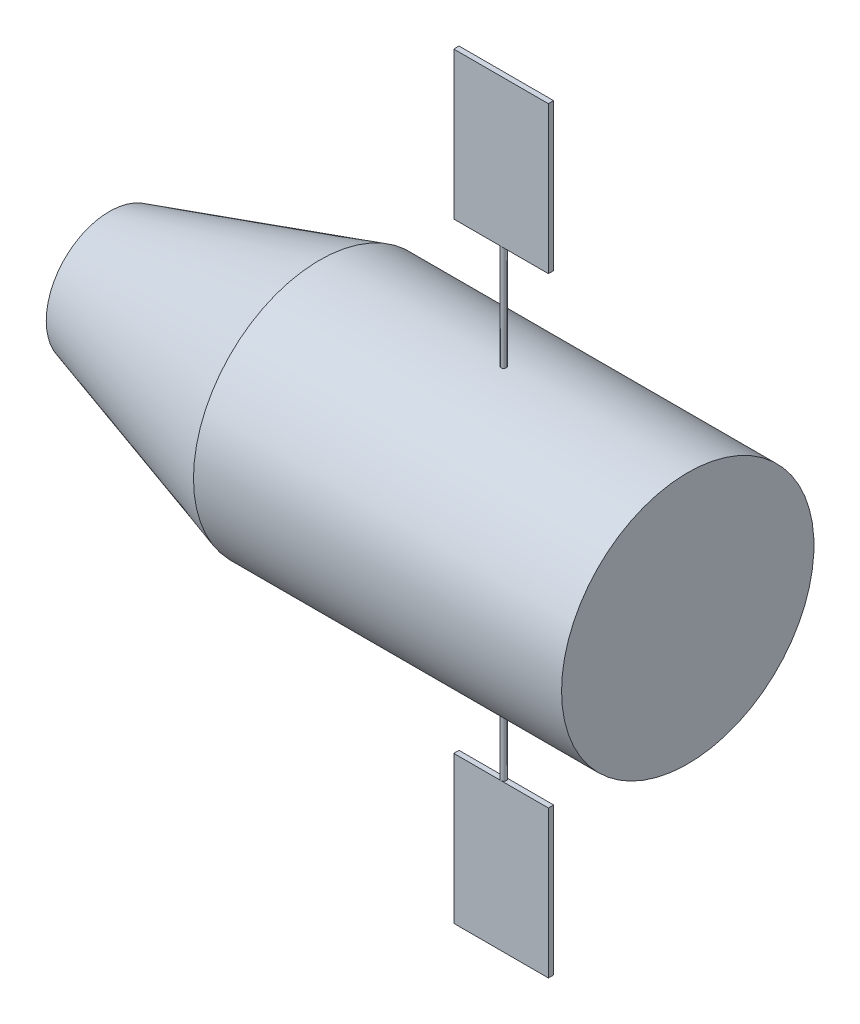
ISO-10303-21;
HEADER;
FILE_DESCRIPTION(('STEP AP214'),'2;1');
FILE_NAME('part.step','',(''),(''),'','','');
FILE_SCHEMA(('AUTOMOTIVE_DESIGN { 1 0 10303 214 1 1 1 1 }'));
ENDSEC;
DATA;
#1=APPLICATION_CONTEXT('core data for automotive mechanical design processes');
#2=APPLICATION_PROTOCOL_DEFINITION('international standard','automotive_design',2000,#1);
#3=PRODUCT_CONTEXT('',#1,'mechanical');
#4=PRODUCT('Part','Part','',(#3));
#5=PRODUCT_RELATED_PRODUCT_CATEGORY('part','',(#4));
#6=PRODUCT_DEFINITION_FORMATION('','',#4);
#7=PRODUCT_DEFINITION_CONTEXT('part definition',#1,'design');
#8=PRODUCT_DEFINITION('design','',#6,#7);
#9=PRODUCT_DEFINITION_SHAPE('','',#8);
#10=(LENGTH_UNIT() NAMED_UNIT(*) SI_UNIT(.MILLI.,.METRE.));
#11=(NAMED_UNIT(*) PLANE_ANGLE_UNIT() SI_UNIT($,.RADIAN.));
#12=(NAMED_UNIT(*) SI_UNIT($,.STERADIAN.) SOLID_ANGLE_UNIT());
#13=UNCERTAINTY_MEASURE_WITH_UNIT(LENGTH_MEASURE(1.E-05),#10,'distance_accuracy_value','');
#14=(GEOMETRIC_REPRESENTATION_CONTEXT(3) GLOBAL_UNCERTAINTY_ASSIGNED_CONTEXT((#13)) GLOBAL_UNIT_ASSIGNED_CONTEXT((#10,
#11,#12)) REPRESENTATION_CONTEXT('',''));
#15=CARTESIAN_POINT('',(0.,0.,0.));
#16=DIRECTION('',(0.,0.,1.));
#17=DIRECTION('',(1.,0.,0.));
#18=AXIS2_PLACEMENT_3D('',#15,#16,#17);
#19=CARTESIAN_POINT('',(66.,-44.,0.5));
#20=DIRECTION('',(0.,-1.,0.));
#21=DIRECTION('',(0.,0.,-1.));
#22=AXIS2_PLACEMENT_3D('',#19,#20,#21);
#23=PLANE('',#22);
#24=DIRECTION('',(-1.,0.,0.));
#25=VECTOR('',#24,1.);
#26=CARTESIAN_POINT('',(66.,-44.,-0.5));
#27=LINE('',#26,#25);
#28=CARTESIAN_POINT('',(84.,-44.,-0.5));
#29=VERTEX_POINT('',#28);
#30=CARTESIAN_POINT('',(66.,-44.,-0.5));
#31=VERTEX_POINT('',#30);
#32=EDGE_CURVE('E87',#29,#31,#27,.T.);
#33=ORIENTED_EDGE('',*,*,#32,.T.);
#34=DIRECTION('',(0.,0.,-1.));
#35=VECTOR('',#34,1.);
#36=CARTESIAN_POINT('',(66.,-44.,0.5));
#37=LINE('',#36,#35);
#38=CARTESIAN_POINT('',(66.,-44.,0.5));
#39=VERTEX_POINT('',#38);
#40=EDGE_CURVE('E12',#39,#31,#37,.T.);
#41=ORIENTED_EDGE('',*,*,#40,.F.);
#42=DIRECTION('',(-1.,0.,0.));
#43=VECTOR('',#42,1.);
#44=CARTESIAN_POINT('',(66.,-44.,0.5));
#45=LINE('',#44,#43);
#46=CARTESIAN_POINT('',(84.,-44.,0.5));
#47=VERTEX_POINT('',#46);
#48=EDGE_CURVE('E105',#47,#39,#45,.T.);
#49=ORIENTED_EDGE('',*,*,#48,.F.);
#50=DIRECTION('',(0.,0.,-1.));
#51=VECTOR('',#50,1.);
#52=CARTESIAN_POINT('',(84.,-44.,0.5));
#53=LINE('',#52,#51);
#54=EDGE_CURVE('E99',#47,#29,#53,.T.);
#55=ORIENTED_EDGE('',*,*,#54,.T.);
#56=EDGE_LOOP('',(#33,#41,#49,#55));
#57=FACE_BOUND('',#56,.T.);
#58=ADVANCED_FACE('F43',(#57),#23,.F.);
#59=CARTESIAN_POINT('',(66.,-44.,0.5));
#60=DIRECTION('',(1.,0.,0.));
#61=DIRECTION('',(0.,0.,-1.));
#62=AXIS2_PLACEMENT_3D('',#59,#60,#61);
#63=PLANE('',#62);
#64=DIRECTION('',(0.,-1.,0.));
#65=VECTOR('',#64,1.);
#66=CARTESIAN_POINT('',(66.,-44.,-0.5));
#67=LINE('',#66,#65);
#68=CARTESIAN_POINT('',(66.,-72.,-0.5));
#69=VERTEX_POINT('',#68);
#70=EDGE_CURVE('E83',#31,#69,#67,.T.);
#71=ORIENTED_EDGE('',*,*,#70,.T.);
#72=DIRECTION('',(0.,0.,-1.));
#73=VECTOR('',#72,1.);
#74=CARTESIAN_POINT('',(66.,-72.,0.5));
#75=LINE('',#74,#73);
#76=CARTESIAN_POINT('',(66.,-72.,0.5));
#77=VERTEX_POINT('',#76);
#78=EDGE_CURVE('E50',#77,#69,#75,.T.);
#79=ORIENTED_EDGE('',*,*,#78,.F.);
#80=DIRECTION('',(0.,-1.,0.));
#81=VECTOR('',#80,1.);
#82=CARTESIAN_POINT('',(66.,-44.,0.5));
#83=LINE('',#82,#81);
#84=EDGE_CURVE('E95',#39,#77,#83,.T.);
#85=ORIENTED_EDGE('',*,*,#84,.F.);
#86=ORIENTED_EDGE('',*,*,#40,.T.);
#87=EDGE_LOOP('',(#71,#79,#85,#86));
#88=FACE_BOUND('',#87,.T.);
#89=ADVANCED_FACE('F94',(#88),#63,.F.);
#90=CARTESIAN_POINT('',(66.,-72.,0.5));
#91=DIRECTION('',(0.,1.,0.));
#92=DIRECTION('',(0.,0.,1.));
#93=AXIS2_PLACEMENT_3D('',#90,#91,#92);
#94=PLANE('',#93);
#95=DIRECTION('',(1.,0.,0.));
#96=VECTOR('',#95,1.);
#97=CARTESIAN_POINT('',(66.,-72.,-0.5));
#98=LINE('',#97,#96);
#99=CARTESIAN_POINT('',(84.,-72.,-0.5));
#100=VERTEX_POINT('',#99);
#101=EDGE_CURVE('E88',#69,#100,#98,.T.);
#102=ORIENTED_EDGE('',*,*,#101,.T.);
#103=DIRECTION('',(0.,0.,-1.));
#104=VECTOR('',#103,1.);
#105=CARTESIAN_POINT('',(84.,-72.,0.5));
#106=LINE('',#105,#104);
#107=CARTESIAN_POINT('',(84.,-72.,0.5));
#108=VERTEX_POINT('',#107);
#109=EDGE_CURVE('E111',#108,#100,#106,.T.);
#110=ORIENTED_EDGE('',*,*,#109,.F.);
#111=DIRECTION('',(1.,0.,0.));
#112=VECTOR('',#111,1.);
#113=CARTESIAN_POINT('',(66.,-72.,0.5));
#114=LINE('',#113,#112);
#115=EDGE_CURVE('E62',#77,#108,#114,.T.);
#116=ORIENTED_EDGE('',*,*,#115,.F.);
#117=ORIENTED_EDGE('',*,*,#78,.T.);
#118=EDGE_LOOP('',(#102,#110,#116,#117));
#119=FACE_BOUND('',#118,.T.);
#120=ADVANCED_FACE('F114',(#119),#94,.F.);
#121=CARTESIAN_POINT('',(84.,-44.,0.5));
#122=DIRECTION('',(-1.,0.,0.));
#123=DIRECTION('',(0.,0.,1.));
#124=AXIS2_PLACEMENT_3D('',#121,#122,#123);
#125=PLANE('',#124);
#126=DIRECTION('',(0.,1.,0.));
#127=VECTOR('',#126,1.);
#128=CARTESIAN_POINT('',(84.,-44.,-0.5));
#129=LINE('',#128,#127);
#130=EDGE_CURVE('E103',#100,#29,#129,.T.);
#131=ORIENTED_EDGE('',*,*,#130,.T.);
#132=ORIENTED_EDGE('',*,*,#54,.F.);
#133=DIRECTION('',(0.,1.,0.));
#134=VECTOR('',#133,1.);
#135=CARTESIAN_POINT('',(84.,-44.,0.5));
#136=LINE('',#135,#134);
#137=EDGE_CURVE('E57',#108,#47,#136,.T.);
#138=ORIENTED_EDGE('',*,*,#137,.F.);
#139=ORIENTED_EDGE('',*,*,#109,.T.);
#140=EDGE_LOOP('',(#131,#132,#138,#139));
#141=FACE_BOUND('',#140,.T.);
#142=ADVANCED_FACE('F116',(#141),#125,.F.);
#143=CARTESIAN_POINT('',(84.,-44.,0.5));
#144=DIRECTION('',(0.,0.,-1.));
#145=DIRECTION('',(-1.,0.,0.));
#146=AXIS2_PLACEMENT_3D('',#143,#144,#145);
#147=PLANE('',#146);
#148=ORIENTED_EDGE('',*,*,#48,.T.);
#149=ORIENTED_EDGE('',*,*,#84,.T.);
#150=ORIENTED_EDGE('',*,*,#115,.T.);
#151=ORIENTED_EDGE('',*,*,#137,.T.);
#152=EDGE_LOOP('',(#148,#149,#150,#151));
#153=FACE_BOUND('',#152,.T.);
#154=ADVANCED_FACE('F117',(#153),#147,.F.);
#155=CARTESIAN_POINT('',(84.,-44.,-0.5));
#156=DIRECTION('',(0.,0.,-1.));
#157=DIRECTION('',(-1.,0.,0.));
#158=AXIS2_PLACEMENT_3D('',#155,#156,#157);
#159=PLANE('',#158);
#160=ORIENTED_EDGE('',*,*,#32,.F.);
#161=ORIENTED_EDGE('',*,*,#130,.F.);
#162=ORIENTED_EDGE('',*,*,#101,.F.);
#163=ORIENTED_EDGE('',*,*,#70,.F.);
#164=EDGE_LOOP('',(#160,#161,#162,#163));
#165=FACE_BOUND('',#164,.T.);
#166=ADVANCED_FACE('F84',(#165),#159,.T.);
#167=CLOSED_SHELL('',(#58,#89,#120,#142,#154,#166));
#168=MANIFOLD_SOLID_BREP('B2',#167);
#169=CARTESIAN_POINT('',(66.,44.,0.5));
#170=DIRECTION('',(1.,0.,0.));
#171=DIRECTION('',(0.,0.,-1.));
#172=AXIS2_PLACEMENT_3D('',#169,#170,#171);
#173=PLANE('',#172);
#174=DIRECTION('',(0.,-1.,0.));
#175=VECTOR('',#174,1.);
#176=CARTESIAN_POINT('',(66.,44.,-0.5));
#177=LINE('',#176,#175);
#178=CARTESIAN_POINT('',(66.,72.,-0.5));
#179=VERTEX_POINT('',#178);
#180=CARTESIAN_POINT('',(66.,44.,-0.5));
#181=VERTEX_POINT('',#180);
#182=EDGE_CURVE('E217',#179,#181,#177,.T.);
#183=ORIENTED_EDGE('',*,*,#182,.T.);
#184=DIRECTION('',(0.,0.,-1.));
#185=VECTOR('',#184,1.);
#186=CARTESIAN_POINT('',(66.,44.,0.5));
#187=LINE('',#186,#185);
#188=CARTESIAN_POINT('',(66.,44.,0.5));
#189=VERTEX_POINT('',#188);
#190=EDGE_CURVE('E41',#189,#181,#187,.T.);
#191=ORIENTED_EDGE('',*,*,#190,.F.);
#192=DIRECTION('',(0.,-1.,0.));
#193=VECTOR('',#192,1.);
#194=CARTESIAN_POINT('',(66.,44.,0.5));
#195=LINE('',#194,#193);
#196=CARTESIAN_POINT('',(66.,72.,0.5));
#197=VERTEX_POINT('',#196);
#198=EDGE_CURVE('E235',#197,#189,#195,.T.);
#199=ORIENTED_EDGE('',*,*,#198,.F.);
#200=DIRECTION('',(0.,0.,-1.));
#201=VECTOR('',#200,1.);
#202=CARTESIAN_POINT('',(66.,72.,0.5));
#203=LINE('',#202,#201);
#204=EDGE_CURVE('E229',#197,#179,#203,.T.);
#205=ORIENTED_EDGE('',*,*,#204,.T.);
#206=EDGE_LOOP('',(#183,#191,#199,#205));
#207=FACE_BOUND('',#206,.T.);
#208=ADVANCED_FACE('F173',(#207),#173,.F.);
#209=CARTESIAN_POINT('',(66.,44.,0.5));
#210=DIRECTION('',(0.,1.,0.));
#211=DIRECTION('',(0.,0.,1.));
#212=AXIS2_PLACEMENT_3D('',#209,#210,#211);
#213=PLANE('',#212);
#214=DIRECTION('',(1.,0.,0.));
#215=VECTOR('',#214,1.);
#216=CARTESIAN_POINT('',(66.,44.,-0.5));
#217=LINE('',#216,#215);
#218=CARTESIAN_POINT('',(84.,44.,-0.5));
#219=VERTEX_POINT('',#218);
#220=EDGE_CURVE('E213',#181,#219,#217,.T.);
#221=ORIENTED_EDGE('',*,*,#220,.T.);
#222=DIRECTION('',(0.,0.,-1.));
#223=VECTOR('',#222,1.);
#224=CARTESIAN_POINT('',(84.,44.,0.5));
#225=LINE('',#224,#223);
#226=CARTESIAN_POINT('',(84.,44.,0.5));
#227=VERTEX_POINT('',#226);
#228=EDGE_CURVE('E180',#227,#219,#225,.T.);
#229=ORIENTED_EDGE('',*,*,#228,.F.);
#230=DIRECTION('',(1.,0.,0.));
#231=VECTOR('',#230,1.);
#232=CARTESIAN_POINT('',(66.,44.,0.5));
#233=LINE('',#232,#231);
#234=EDGE_CURVE('E225',#189,#227,#233,.T.);
#235=ORIENTED_EDGE('',*,*,#234,.F.);
#236=ORIENTED_EDGE('',*,*,#190,.T.);
#237=EDGE_LOOP('',(#221,#229,#235,#236));
#238=FACE_BOUND('',#237,.T.);
#239=ADVANCED_FACE('F224',(#238),#213,.F.);
#240=CARTESIAN_POINT('',(84.,44.,0.5));
#241=DIRECTION('',(-1.,0.,0.));
#242=DIRECTION('',(0.,0.,1.));
#243=AXIS2_PLACEMENT_3D('',#240,#241,#242);
#244=PLANE('',#243);
#245=DIRECTION('',(0.,1.,0.));
#246=VECTOR('',#245,1.);
#247=CARTESIAN_POINT('',(84.,44.,-0.5));
#248=LINE('',#247,#246);
#249=CARTESIAN_POINT('',(84.,72.,-0.5));
#250=VERTEX_POINT('',#249);
#251=EDGE_CURVE('E218',#219,#250,#248,.T.);
#252=ORIENTED_EDGE('',*,*,#251,.T.);
#253=DIRECTION('',(0.,0.,-1.));
#254=VECTOR('',#253,1.);
#255=CARTESIAN_POINT('',(84.,72.,0.5));
#256=LINE('',#255,#254);
#257=CARTESIAN_POINT('',(84.,72.,0.5));
#258=VERTEX_POINT('',#257);
#259=EDGE_CURVE('E241',#258,#250,#256,.T.);
#260=ORIENTED_EDGE('',*,*,#259,.F.);
#261=DIRECTION('',(0.,1.,0.));
#262=VECTOR('',#261,1.);
#263=CARTESIAN_POINT('',(84.,44.,0.5));
#264=LINE('',#263,#262);
#265=EDGE_CURVE('E192',#227,#258,#264,.T.);
#266=ORIENTED_EDGE('',*,*,#265,.F.);
#267=ORIENTED_EDGE('',*,*,#228,.T.);
#268=EDGE_LOOP('',(#252,#260,#266,#267));
#269=FACE_BOUND('',#268,.T.);
#270=ADVANCED_FACE('F244',(#269),#244,.F.);
#271=CARTESIAN_POINT('',(66.,72.,0.5));
#272=DIRECTION('',(0.,-1.,0.));
#273=DIRECTION('',(0.,0.,-1.));
#274=AXIS2_PLACEMENT_3D('',#271,#272,#273);
#275=PLANE('',#274);
#276=DIRECTION('',(-1.,0.,0.));
#277=VECTOR('',#276,1.);
#278=CARTESIAN_POINT('',(66.,72.,-0.5));
#279=LINE('',#278,#277);
#280=EDGE_CURVE('E233',#250,#179,#279,.T.);
#281=ORIENTED_EDGE('',*,*,#280,.T.);
#282=ORIENTED_EDGE('',*,*,#204,.F.);
#283=DIRECTION('',(-1.,0.,0.));
#284=VECTOR('',#283,1.);
#285=CARTESIAN_POINT('',(66.,72.,0.5));
#286=LINE('',#285,#284);
#287=EDGE_CURVE('E187',#258,#197,#286,.T.);
#288=ORIENTED_EDGE('',*,*,#287,.F.);
#289=ORIENTED_EDGE('',*,*,#259,.T.);
#290=EDGE_LOOP('',(#281,#282,#288,#289));
#291=FACE_BOUND('',#290,.T.);
#292=ADVANCED_FACE('F246',(#291),#275,.F.);
#293=CARTESIAN_POINT('',(66.,72.,0.5));
#294=DIRECTION('',(0.,0.,-1.));
#295=DIRECTION('',(-1.,0.,0.));
#296=AXIS2_PLACEMENT_3D('',#293,#294,#295);
#297=PLANE('',#296);
#298=ORIENTED_EDGE('',*,*,#198,.T.);
#299=ORIENTED_EDGE('',*,*,#234,.T.);
#300=ORIENTED_EDGE('',*,*,#265,.T.);
#301=ORIENTED_EDGE('',*,*,#287,.T.);
#302=EDGE_LOOP('',(#298,#299,#300,#301));
#303=FACE_BOUND('',#302,.T.);
#304=ADVANCED_FACE('F247',(#303),#297,.F.);
#305=CARTESIAN_POINT('',(66.,72.,-0.5));
#306=DIRECTION('',(0.,0.,-1.));
#307=DIRECTION('',(-1.,0.,0.));
#308=AXIS2_PLACEMENT_3D('',#305,#306,#307);
#309=PLANE('',#308);
#310=ORIENTED_EDGE('',*,*,#182,.F.);
#311=ORIENTED_EDGE('',*,*,#280,.F.);
#312=ORIENTED_EDGE('',*,*,#251,.F.);
#313=ORIENTED_EDGE('',*,*,#220,.F.);
#314=EDGE_LOOP('',(#310,#311,#312,#313));
#315=FACE_BOUND('',#314,.T.);
#316=ADVANCED_FACE('F214',(#315),#309,.T.);
#317=CLOSED_SHELL('',(#208,#239,#270,#292,#304,#316));
#318=MANIFOLD_SOLID_BREP('B6',#317);
#319=CARTESIAN_POINT('',(0.,0.,0.));
#320=DIRECTION('',(-1.,0.,0.));
#321=DIRECTION('',(0.,0.,1.));
#322=AXIS2_PLACEMENT_3D('',#319,#320,#321);
#323=CYLINDRICAL_SURFACE('',#322,24.);
#324=CARTESIAN_POINT('',(75.,-23.9947911014036,-0.499999999999999));
#325=CARTESIAN_POINT('',(75.0280819495801,-23.9947911717735,-0.499998755689007));
#326=CARTESIAN_POINT('',(75.0561841836602,-23.9948409288091,-0.497626272717139));
#327=CARTESIAN_POINT('',(75.1116144773417,-23.9950346325307,-0.488195015620973));
#328=CARTESIAN_POINT('',(75.1389415674896,-23.9951786921701,-0.481130621491828));
#329=CARTESIAN_POINT('',(75.1920105204714,-23.9955446747938,-0.462516937718088));
#330=CARTESIAN_POINT('',(75.2177531423658,-23.9957665601481,-0.450969815265475));
#331=CARTESIAN_POINT('',(75.2669272783374,-23.996263143864,-0.423721495866863));
#332=CARTESIAN_POINT('',(75.2903593600708,-23.9965378292044,-0.408021322755113));
#333=CARTESIAN_POINT('',(75.3342614386907,-23.9971091580979,-0.372906879949391));
#334=CARTESIAN_POINT('',(75.3547307226628,-23.9974058069099,-0.353491718948472));
#335=CARTESIAN_POINT('',(75.3921202442228,-23.9979875800334,-0.311499734578782));
#336=CARTESIAN_POINT('',(75.4090403414934,-23.9982727038888,-0.28892278626754));
#337=CARTESIAN_POINT('',(75.4388513990624,-23.9987992943443,-0.241246617131625));
#338=CARTESIAN_POINT('',(75.4517420680967,-23.9990407577879,-0.216147214146613));
#339=CARTESIAN_POINT('',(75.4731263972913,-23.9994527777224,-0.164139942789844));
#340=CARTESIAN_POINT('',(75.4816200705279,-23.9996233344243,-0.137232079796686));
#341=CARTESIAN_POINT('',(75.493968145675,-23.999874291777,-0.0823758263059951));
#342=CARTESIAN_POINT('',(75.4978232212284,-23.9999547055188,-0.0544275875055707));
#343=CARTESIAN_POINT('',(75.5007867396882,-24.0000163554521,0.00171946708564266));
#344=CARTESIAN_POINT('',(75.4998951961563,-23.999997591927,0.0299182821602723));
#345=CARTESIAN_POINT('',(75.4933913678948,-23.9998630141025,0.0857614554513595));
#346=CARTESIAN_POINT('',(75.4877798146057,-23.9997472148404,0.113405898896955));
#347=CARTESIAN_POINT('',(75.4719963871953,-23.9994316360279,0.167360271530591));
#348=CARTESIAN_POINT('',(75.4618245057419,-23.9992318563425,0.193670198572926));
#349=CARTESIAN_POINT('',(75.437208328201,-23.9987708108167,0.244211022190753));
#350=CARTESIAN_POINT('',(75.4227636966463,-23.9985095401488,0.268441755329372));
#351=CARTESIAN_POINT('',(75.39001230802,-23.9979549633349,0.314134562622748));
#352=CARTESIAN_POINT('',(75.3717055475,-23.9976616571604,0.335596634305513));
#353=CARTESIAN_POINT('',(75.3317454196374,-23.9970760050408,0.375147156987356));
#354=CARTESIAN_POINT('',(75.3100914166588,-23.996783659289,0.393234965776574));
#355=CARTESIAN_POINT('',(75.2640537330293,-23.9962329436889,0.425518566789635));
#356=CARTESIAN_POINT('',(75.2396700519826,-23.9959745738457,0.439714358449062));
#357=CARTESIAN_POINT('',(75.1888648338684,-23.9955209451355,0.463810877285174));
#358=CARTESIAN_POINT('',(75.1624432874293,-23.9953256865588,0.473711584708515));
#359=CARTESIAN_POINT('',(75.1083125209521,-23.9950203083275,0.48893647778771));
#360=CARTESIAN_POINT('',(75.0806033026356,-23.9949101885591,0.494260669561768));
#361=CARTESIAN_POINT('',(75.0246893497948,-23.9947875239974,0.500180609434563));
#362=CARTESIAN_POINT('',(74.9964847094237,-23.9947749608608,0.500777246449648));
#363=CARTESIAN_POINT('',(74.9403756480201,-23.9948487781901,0.497227455712553));
#364=CARTESIAN_POINT('',(74.9124712268269,-23.9949351586031,0.493081030498498));
#365=CARTESIAN_POINT('',(74.857757195388,-23.9951971081247,0.480163554406991));
#366=CARTESIAN_POINT('',(74.8309474899532,-23.9953726694609,0.47139290654761));
#367=CARTESIAN_POINT('',(74.7791810121831,-23.9957931820358,0.449476364930966));
#368=CARTESIAN_POINT('',(74.7542242415235,-23.9960381333374,0.436330467217032));
#369=CARTESIAN_POINT('',(74.7068679784059,-23.9965698557597,0.406034302106228));
#370=CARTESIAN_POINT('',(74.6844688691551,-23.9968566331324,0.388883435825437));
#371=CARTESIAN_POINT('',(74.6428676091837,-23.9974396552186,0.351065066859976));
#372=CARTESIAN_POINT('',(74.623665463065,-23.9977358999457,0.330397559113468));
#373=CARTESIAN_POINT('',(74.5890002578636,-23.9983045124331,0.286128785025378));
#374=CARTESIAN_POINT('',(74.5735377723192,-23.9985768765268,0.26252706951424));
#375=CARTESIAN_POINT('',(74.5467947457973,-23.9990669706346,0.213062166399238));
#376=CARTESIAN_POINT('',(74.5355141979853,-23.9992847007379,0.18719898249127));
#377=CARTESIAN_POINT('',(74.5174562604969,-23.9996409638288,0.133947475527782));
#378=CARTESIAN_POINT('',(74.5106784974545,-23.9997795033825,0.106559279128785));
#379=CARTESIAN_POINT('',(74.5018172983839,-23.9999617933502,0.0510333817508725));
#380=CARTESIAN_POINT('',(74.4997338647546,-24.0000055437156,0.0228956803889426));
#381=CARTESIAN_POINT('',(74.500320518968,-23.9999933233209,-0.0333247031519557));
#382=CARTESIAN_POINT('',(74.5029896988276,-23.9999373716086,-0.0614073948143683));
#383=CARTESIAN_POINT('',(74.5130039534819,-23.9997320907151,-0.116726003807581));
#384=CARTESIAN_POINT('',(74.5203490376178,-23.9995827613472,-0.143961919446632));
#385=CARTESIAN_POINT('',(74.5395065648595,-23.9992075514119,-0.196814417477178));
#386=CARTESIAN_POINT('',(74.5513190883632,-23.9989816694667,-0.222430970716293));
#387=CARTESIAN_POINT('',(74.5790756041927,-23.9984788195123,-0.271316544990831));
#388=CARTESIAN_POINT('',(74.5950194404813,-23.9982018534325,-0.294585654641794));
#389=CARTESIAN_POINT('',(74.6305876653042,-23.9976280107834,-0.338119367783993));
#390=CARTESIAN_POINT('',(74.6502123652804,-23.9973311325307,-0.358383716779249));
#391=CARTESIAN_POINT('',(74.692591003332,-23.9967508715343,-0.395335453520526));
#392=CARTESIAN_POINT('',(74.7153457165506,-23.996467492157,-0.412021952589706));
#393=CARTESIAN_POINT('',(74.7633447928149,-23.9959461123415,-0.441345738162929));
#394=CARTESIAN_POINT('',(74.7885905419077,-23.9957081373854,-0.45398075356041));
#395=CARTESIAN_POINT('',(74.8408258269602,-23.9953048986869,-0.474818350401131));
#396=CARTESIAN_POINT('',(74.8678132342671,-23.9951395480435,-0.483026231972628));
#397=CARTESIAN_POINT('',(74.9124765885322,-23.9949445249041,-0.49259497139886));
#398=CARTESIAN_POINT('',(74.9298624706482,-23.9948872399572,-0.495368377808318));
#399=CARTESIAN_POINT('',(74.9648295825434,-23.9948105061715,-0.499071281667808));
#400=CARTESIAN_POINT('',(74.9824108122953,-23.9947910573274,-0.500000779376785));
#401=CARTESIAN_POINT('',(75.,-23.9947911014036,-0.499999999999999));
#402=B_SPLINE_CURVE_WITH_KNOTS('',3,(#324,#325,#326,#327,#328,#329,#330,#331,#332,#333,#334,
#335,#336,#337,#338,#339,#340,#341,#342,#343,#344,#345,#346,#347,#348,#349,#350,#351,#352,#353,
#354,#355,#356,#357,#358,#359,#360,#361,#362,#363,#364,#365,#366,#367,#368,#369,#370,#371,#372,
#373,#374,#375,#376,#377,#378,#379,#380,#381,#382,#383,#384,#385,#386,#387,#388,#389,#390,#391,
#392,#393,#394,#395,#396,#397,#398,#399,#400,#401),.UNSPECIFIED.,.T.,.F.,(4,2,2,2,2,2,2,2,2,2,2,
2,2,2,2,2,2,2,2,2,2,2,2,2,2,2,2,2,2,2,2,2,2,2,2,2,2,2,4),(0.,0.0841816471250019,
0.168464309921562,0.252706276587457,0.33692749475649,0.421168944834114,0.505413724770952,
0.589664592864814,0.673915210396551,0.758153591104818,0.842391731132985,0.926616819528445,
1.01084204334113,1.09507388169852,1.17930579526157,1.26355372402558,1.34780166500711,
1.43204999344574,1.51629820925515,1.60053058359942,1.68476291286899,1.7689879021934,
1.85321296768523,1.93745063586644,2.02168842529997,2.1059391257988,2.19018968861011,
2.27443326458485,2.35867688361073,2.44290440968517,2.52713210402441,2.6113613142311,
2.69558734361068,2.77982050266193,2.86407455961739,2.94837576393767,3.03257581826584,
3.08530317596895,3.13803052626743),.UNSPECIFIED.);
#403=CARTESIAN_POINT('',(75.,-23.9947911014036,-0.499999999999999));
#404=VERTEX_POINT('',#403);
#405=EDGE_CURVE('E307',#404,#404,#402,.T.);
#406=ORIENTED_EDGE('',*,*,#405,.F.);
#407=EDGE_LOOP('',(#406));
#408=FACE_BOUND('',#407,.T.);
#409=CARTESIAN_POINT('',(40.,0.,0.));
#410=DIRECTION('',(-1.,0.,0.));
#411=DIRECTION('',(0.,0.,1.));
#412=AXIS2_PLACEMENT_3D('',#409,#410,#411);
#413=CIRCLE('',#412,24.);
#414=CARTESIAN_POINT('',(40.,0.,24.));
#415=VERTEX_POINT('',#414);
#416=EDGE_CURVE('E315',#415,#415,#413,.T.);
#417=ORIENTED_EDGE('',*,*,#416,.F.);
#418=EDGE_LOOP('',(#417));
#419=FACE_BOUND('',#418,.T.);
#420=CARTESIAN_POINT('',(110.,0.,0.));
#421=DIRECTION('',(-1.,0.,0.));
#422=DIRECTION('',(0.,0.,1.));
#423=AXIS2_PLACEMENT_3D('',#420,#421,#422);
#424=CIRCLE('',#423,24.);
#425=CARTESIAN_POINT('',(110.,0.,24.));
#426=VERTEX_POINT('',#425);
#427=EDGE_CURVE('E311',#426,#426,#424,.T.);
#428=ORIENTED_EDGE('',*,*,#427,.T.);
#429=EDGE_LOOP('',(#428));
#430=FACE_BOUND('',#429,.T.);
#431=CARTESIAN_POINT('',(75.,23.9947911014036,-0.499999999999999));
#432=CARTESIAN_POINT('',(74.9719180504199,23.9947911717735,-0.499998755689007));
#433=CARTESIAN_POINT('',(74.9438158163398,23.9948409288091,-0.49762627271714));
#434=CARTESIAN_POINT('',(74.8883855226583,23.9950346325307,-0.488195015620975));
#435=CARTESIAN_POINT('',(74.8610584325104,23.9951786921701,-0.481130621491829));
#436=CARTESIAN_POINT('',(74.8079894795285,23.9955446747938,-0.462516937718086));
#437=CARTESIAN_POINT('',(74.7822468576342,23.9957665601481,-0.450969815265469));
#438=CARTESIAN_POINT('',(74.7330727216626,23.996263143864,-0.423721495866854));
#439=CARTESIAN_POINT('',(74.7096406399292,23.9965378292044,-0.408021322755108));
#440=CARTESIAN_POINT('',(74.6657385613093,23.9971091580979,-0.372906879949391));
#441=CARTESIAN_POINT('',(74.6452692773371,23.9974058069099,-0.353491718948471));
#442=CARTESIAN_POINT('',(74.6078797557772,23.9979875800334,-0.311499734578783));
#443=CARTESIAN_POINT('',(74.5909596585066,23.9982727038888,-0.28892278626754));
#444=CARTESIAN_POINT('',(74.5611486009376,23.9987992943443,-0.241246617131625));
#445=CARTESIAN_POINT('',(74.5482579319032,23.9990407577879,-0.216147214146613));
#446=CARTESIAN_POINT('',(74.5268736027087,23.9994527777224,-0.164139942789844));
#447=CARTESIAN_POINT('',(74.518379929472,23.9996233344243,-0.137232079796686));
#448=CARTESIAN_POINT('',(74.506031854325,23.999874291777,-0.0823758263059951));
#449=CARTESIAN_POINT('',(74.5021767787716,23.9999547055188,-0.0544275875055707));
#450=CARTESIAN_POINT('',(74.4992132603118,24.0000163554521,0.00171946708564266));
#451=CARTESIAN_POINT('',(74.5001048038437,23.999997591927,0.0299182821602723));
#452=CARTESIAN_POINT('',(74.5066086321052,23.9998630141025,0.0857614554513595));
#453=CARTESIAN_POINT('',(74.5122201853943,23.9997472148404,0.113405898896955));
#454=CARTESIAN_POINT('',(74.5280036128047,23.9994316360279,0.167360271530591));
#455=CARTESIAN_POINT('',(74.5381754942581,23.9992318563425,0.193670198572926));
#456=CARTESIAN_POINT('',(74.562791671799,23.9987708108167,0.244211022190753));
#457=CARTESIAN_POINT('',(74.5772363033537,23.9985095401488,0.268441755329372));
#458=CARTESIAN_POINT('',(74.60998769198,23.9979549633349,0.314134562622748));
#459=CARTESIAN_POINT('',(74.6282944525,23.9976616571604,0.335596634305513));
#460=CARTESIAN_POINT('',(74.6682545803626,23.9970760050408,0.375147156987356));
#461=CARTESIAN_POINT('',(74.6899085833412,23.996783659289,0.393234965776574));
#462=CARTESIAN_POINT('',(74.7359462669707,23.9962329436889,0.425518566789635));
#463=CARTESIAN_POINT('',(74.7603299480174,23.9959745738457,0.439714358449062));
#464=CARTESIAN_POINT('',(74.8111351661316,23.9955209451355,0.463810877285174));
#465=CARTESIAN_POINT('',(74.8375567125707,23.9953256865588,0.473711584708515));
#466=CARTESIAN_POINT('',(74.8916874790479,23.9950203083275,0.48893647778771));
#467=CARTESIAN_POINT('',(74.9193966973644,23.9949101885591,0.494260669561768));
#468=CARTESIAN_POINT('',(74.9753106502052,23.9947875239974,0.500180609434563));
#469=CARTESIAN_POINT('',(75.0035152905763,23.9947749608608,0.500777246449648));
#470=CARTESIAN_POINT('',(75.0596243519799,23.9948487781901,0.497227455712553));
#471=CARTESIAN_POINT('',(75.0875287731731,23.9949351586031,0.493081030498498));
#472=CARTESIAN_POINT('',(75.142242804612,23.9951971081247,0.480163554406991));
#473=CARTESIAN_POINT('',(75.1690525100468,23.9953726694609,0.47139290654761));
#474=CARTESIAN_POINT('',(75.2208189878169,23.9957931820358,0.449476364930966));
#475=CARTESIAN_POINT('',(75.2457757584765,23.9960381333374,0.436330467217032));
#476=CARTESIAN_POINT('',(75.2931320215941,23.9965698557597,0.406034302106228));
#477=CARTESIAN_POINT('',(75.3155311308449,23.9968566331324,0.388883435825437));
#478=CARTESIAN_POINT('',(75.3571323908163,23.9974396552186,0.351065066859976));
#479=CARTESIAN_POINT('',(75.376334536935,23.9977358999457,0.330397559113468));
#480=CARTESIAN_POINT('',(75.4109997421364,23.9983045124331,0.286128785025378));
#481=CARTESIAN_POINT('',(75.4264622276807,23.9985768765268,0.26252706951424));
#482=CARTESIAN_POINT('',(75.4532052542027,23.9990669706346,0.213062166399238));
#483=CARTESIAN_POINT('',(75.4644858020147,23.9992847007379,0.18719898249127));
#484=CARTESIAN_POINT('',(75.4825437395031,23.9996409638288,0.133947475527782));
#485=CARTESIAN_POINT('',(75.4893215025455,23.9997795033825,0.106559279128785));
#486=CARTESIAN_POINT('',(75.4981827016161,23.9999617933502,0.0510333817508725));
#487=CARTESIAN_POINT('',(75.5002661352454,24.0000055437156,0.0228956803889426));
#488=CARTESIAN_POINT('',(75.499679481032,23.9999933233209,-0.0333247031519557));
#489=CARTESIAN_POINT('',(75.4970103011724,23.9999373716086,-0.0614073948143683));
#490=CARTESIAN_POINT('',(75.4869960465181,23.9997320907151,-0.116726003807581));
#491=CARTESIAN_POINT('',(75.4796509623822,23.9995827613472,-0.143961919446632));
#492=CARTESIAN_POINT('',(75.4604934351404,23.9992075514119,-0.196814417477178));
#493=CARTESIAN_POINT('',(75.4486809116368,23.9989816694667,-0.222430970716293));
#494=CARTESIAN_POINT('',(75.4209243958073,23.9984788195123,-0.271316544990831));
#495=CARTESIAN_POINT('',(75.4049805595187,23.9982018534325,-0.294585654641794));
#496=CARTESIAN_POINT('',(75.3694123346958,23.9976280107834,-0.338119367783993));
#497=CARTESIAN_POINT('',(75.3497876347196,23.9973311325307,-0.358383716779249));
#498=CARTESIAN_POINT('',(75.307408996668,23.9967508715343,-0.395335453520526));
#499=CARTESIAN_POINT('',(75.2846542834494,23.996467492157,-0.412021952589706));
#500=CARTESIAN_POINT('',(75.2366552071851,23.9959461123415,-0.441345738162932));
#501=CARTESIAN_POINT('',(75.2114094580923,23.9957081373854,-0.453980753560413));
#502=CARTESIAN_POINT('',(75.1591741730398,23.9953048986869,-0.474818350401133));
#503=CARTESIAN_POINT('',(75.1321867657329,23.9951395480435,-0.483026231972629));
#504=CARTESIAN_POINT('',(75.0875234114678,23.9949445249041,-0.49259497139886));
#505=CARTESIAN_POINT('',(75.0701375293518,23.9948872399572,-0.495368377808318));
#506=CARTESIAN_POINT('',(75.0351704174566,23.9948105061715,-0.499071281667808));
#507=CARTESIAN_POINT('',(75.0175891877047,23.9947910573274,-0.500000779376785));
#508=CARTESIAN_POINT('',(75.,23.9947911014036,-0.499999999999999));
#509=B_SPLINE_CURVE_WITH_KNOTS('',3,(#431,#432,#433,#434,#435,#436,#437,#438,#439,#440,#441,
#442,#443,#444,#445,#446,#447,#448,#449,#450,#451,#452,#453,#454,#455,#456,#457,#458,#459,#460,
#461,#462,#463,#464,#465,#466,#467,#468,#469,#470,#471,#472,#473,#474,#475,#476,#477,#478,#479,
#480,#481,#482,#483,#484,#485,#486,#487,#488,#489,#490,#491,#492,#493,#494,#495,#496,#497,#498,
#499,#500,#501,#502,#503,#504,#505,#506,#507,#508),.UNSPECIFIED.,.T.,.F.,(4,2,2,2,2,2,2,2,2,2,2,
2,2,2,2,2,2,2,2,2,2,2,2,2,2,2,2,2,2,2,2,2,2,2,2,2,2,2,4),(0.,0.0841816471249879,
0.168464309921562,0.252706276587487,0.33692749475649,0.421168944834115,0.505413724770953,
0.589664592864814,0.673915210396552,0.758153591104818,0.842391731132986,0.926616819528446,
1.01084204334113,1.09507388169852,1.17930579526157,1.26355372402558,1.34780166500711,
1.43204999344575,1.51629820925515,1.60053058359942,1.68476291286899,1.7689879021934,
1.85321296768523,1.93745063586644,2.02168842529997,2.1059391257988,2.19018968861011,
2.27443326458485,2.35867688361074,2.44290440968517,2.52713210402441,2.6113613142311,
2.69558734361068,2.77982050266193,2.86407455961739,2.94837576393769,3.03257581826584,
3.08530317596895,3.13803052626743),.UNSPECIFIED.);
#510=CARTESIAN_POINT('',(75.,23.9947911014036,-0.499999999999999));
#511=VERTEX_POINT('',#510);
#512=EDGE_CURVE('E172',#511,#511,#509,.T.);
#513=ORIENTED_EDGE('',*,*,#512,.F.);
#514=EDGE_LOOP('',(#513));
#515=FACE_BOUND('',#514,.T.);
#516=ADVANCED_FACE('F296',(#408,#419,#430,#515),#323,.T.);
#517=CARTESIAN_POINT('',(0.,12.,0.));
#518=DIRECTION('',(1.,0.,0.));
#519=DIRECTION('',(0.,0.,-1.));
#520=AXIS2_PLACEMENT_3D('',#517,#518,#519);
#521=PLANE('',#520);
#522=CARTESIAN_POINT('',(0.,0.,0.));
#523=DIRECTION('',(-1.,0.,0.));
#524=DIRECTION('',(0.,0.,1.));
#525=AXIS2_PLACEMENT_3D('',#522,#523,#524);
#526=CIRCLE('',#525,12.);
#527=CARTESIAN_POINT('',(0.,0.,12.));
#528=VERTEX_POINT('',#527);
#529=EDGE_CURVE('E356',#528,#528,#526,.T.);
#530=ORIENTED_EDGE('',*,*,#529,.T.);
#531=EDGE_LOOP('',(#530));
#532=FACE_BOUND('',#531,.T.);
#533=ADVANCED_FACE('F298',(#532),#521,.F.);
#534=CARTESIAN_POINT('',(110.,0.,0.));
#535=DIRECTION('',(-1.,0.,0.));
#536=DIRECTION('',(0.,0.,1.));
#537=AXIS2_PLACEMENT_3D('',#534,#535,#536);
#538=PLANE('',#537);
#539=ORIENTED_EDGE('',*,*,#427,.F.);
#540=EDGE_LOOP('',(#539));
#541=FACE_BOUND('',#540,.T.);
#542=ADVANCED_FACE('F334',(#541),#538,.F.);
#543=CARTESIAN_POINT('',(40.,0.,0.));
#544=DIRECTION('',(1.,0.,0.));
#545=DIRECTION('',(0.,0.,-1.));
#546=AXIS2_PLACEMENT_3D('',#543,#544,#545);
#547=CONICAL_SURFACE('',#546,24.,0.291456794477867);
#548=ORIENTED_EDGE('',*,*,#529,.F.);
#549=EDGE_LOOP('',(#548));
#550=FACE_BOUND('',#549,.T.);
#551=ORIENTED_EDGE('',*,*,#416,.T.);
#552=EDGE_LOOP('',(#551));
#553=FACE_BOUND('',#552,.T.);
#554=ADVANCED_FACE('F330',(#550,#553),#547,.T.);
#555=CARTESIAN_POINT('',(75.,-44.,0.));
#556=DIRECTION('',(0.,1.,0.));
#557=DIRECTION('',(0.,0.,1.));
#558=AXIS2_PLACEMENT_3D('',#555,#556,#557);
#559=PLANE('',#558);
#560=CARTESIAN_POINT('',(75.,-44.,0.));
#561=DIRECTION('',(0.,1.,0.));
#562=DIRECTION('',(0.,0.,1.));
#563=AXIS2_PLACEMENT_3D('',#560,#561,#562);
#564=CIRCLE('',#563,0.499999999999999);
#565=CARTESIAN_POINT('',(75.,-44.,0.499999999999999));
#566=VERTEX_POINT('',#565);
#567=EDGE_CURVE('E363',#566,#566,#564,.T.);
#568=ORIENTED_EDGE('',*,*,#567,.F.);
#569=EDGE_LOOP('',(#568));
#570=FACE_BOUND('',#569,.T.);
#571=ADVANCED_FACE('F333',(#570),#559,.F.);
#572=CARTESIAN_POINT('',(75.,44.,0.));
#573=DIRECTION('',(0.,-1.,0.));
#574=DIRECTION('',(0.,0.,-1.));
#575=AXIS2_PLACEMENT_3D('',#572,#573,#574);
#576=CYLINDRICAL_SURFACE('',#575,0.499999999999999);
#577=ORIENTED_EDGE('',*,*,#567,.T.);
#578=EDGE_LOOP('',(#577));
#579=FACE_BOUND('',#578,.T.);
#580=ORIENTED_EDGE('',*,*,#405,.T.);
#581=EDGE_LOOP('',(#580));
#582=FACE_BOUND('',#581,.T.);
#583=ADVANCED_FACE('F327',(#579,#582),#576,.T.);
#584=CARTESIAN_POINT('',(75.,44.,0.));
#585=DIRECTION('',(0.,1.,0.));
#586=DIRECTION('',(0.,0.,1.));
#587=AXIS2_PLACEMENT_3D('',#584,#585,#586);
#588=CIRCLE('',#587,0.499999999999999);
#589=CARTESIAN_POINT('',(75.,44.,0.499999999999999));
#590=VERTEX_POINT('',#589);
#591=EDGE_CURVE('E358',#590,#590,#588,.T.);
#592=ORIENTED_EDGE('',*,*,#591,.F.);
#593=EDGE_LOOP('',(#592));
#594=FACE_BOUND('',#593,.T.);
#595=ORIENTED_EDGE('',*,*,#512,.T.);
#596=EDGE_LOOP('',(#595));
#597=FACE_BOUND('',#596,.T.);
#598=ADVANCED_FACE('F322',(#594,#597),#576,.T.);
#599=CARTESIAN_POINT('',(75.,44.,0.));
#600=DIRECTION('',(0.,1.,0.));
#601=DIRECTION('',(0.,0.,1.));
#602=AXIS2_PLACEMENT_3D('',#599,#600,#601);
#603=PLANE('',#602);
#604=ORIENTED_EDGE('',*,*,#591,.T.);
#605=EDGE_LOOP('',(#604));
#606=FACE_BOUND('',#605,.T.);
#607=ADVANCED_FACE('F326',(#606),#603,.T.);
#608=CLOSED_SHELL('',(#516,#533,#542,#554,#571,#583,#598,#607));
#609=MANIFOLD_SOLID_BREP('B35',#608);
#610=ADVANCED_BREP_SHAPE_REPRESENTATION('',(#18,#168,#318,#609),#14);
#611=SHAPE_DEFINITION_REPRESENTATION(#9,#610);
ENDSEC;
END-ISO-10303-21;
